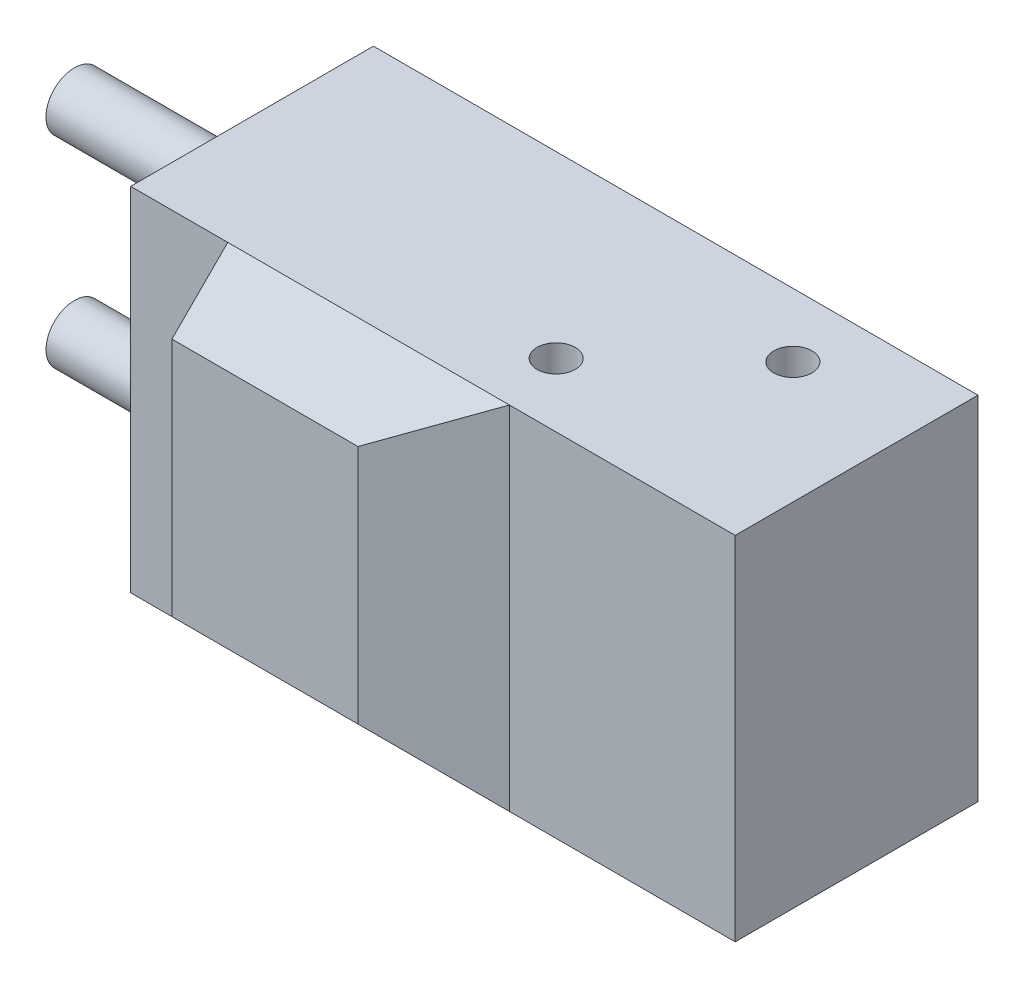
ISO-10303-21;
HEADER;
FILE_DESCRIPTION(('STEP AP214'),'2;1');
FILE_NAME('part.step','',(''),(''),'','','');
FILE_SCHEMA(('AUTOMOTIVE_DESIGN { 1 0 10303 214 1 1 1 1 }'));
ENDSEC;
DATA;
#1=APPLICATION_CONTEXT('core data for automotive mechanical design processes');
#2=APPLICATION_PROTOCOL_DEFINITION('international standard','automotive_design',2000,#1);
#3=PRODUCT_CONTEXT('',#1,'mechanical');
#4=PRODUCT('Part','Part','',(#3));
#5=PRODUCT_RELATED_PRODUCT_CATEGORY('part','',(#4));
#6=PRODUCT_DEFINITION_FORMATION('','',#4);
#7=PRODUCT_DEFINITION_CONTEXT('part definition',#1,'design');
#8=PRODUCT_DEFINITION('design','',#6,#7);
#9=PRODUCT_DEFINITION_SHAPE('','',#8);
#10=(LENGTH_UNIT() NAMED_UNIT(*) SI_UNIT(.MILLI.,.METRE.));
#11=(NAMED_UNIT(*) PLANE_ANGLE_UNIT() SI_UNIT($,.RADIAN.));
#12=(NAMED_UNIT(*) SI_UNIT($,.STERADIAN.) SOLID_ANGLE_UNIT());
#13=UNCERTAINTY_MEASURE_WITH_UNIT(LENGTH_MEASURE(1.E-05),#10,'distance_accuracy_value','');
#14=(GEOMETRIC_REPRESENTATION_CONTEXT(3) GLOBAL_UNCERTAINTY_ASSIGNED_CONTEXT((#13)) GLOBAL_UNIT_ASSIGNED_CONTEXT((#10,
#11,#12)) REPRESENTATION_CONTEXT('',''));
#15=CARTESIAN_POINT('',(0.,0.,0.));
#16=DIRECTION('',(0.,0.,1.));
#17=DIRECTION('',(1.,0.,0.));
#18=AXIS2_PLACEMENT_3D('',#15,#16,#17);
#19=CARTESIAN_POINT('',(0.,0.,25.4));
#20=DIRECTION('',(1.,0.,0.));
#21=DIRECTION('',(0.,0.,-1.));
#22=AXIS2_PLACEMENT_3D('',#19,#20,#21);
#23=PLANE('',#22);
#24=CARTESIAN_POINT('',(0.,28.956,12.7));
#25=DIRECTION('',(1.,0.,0.));
#26=DIRECTION('',(0.,0.,-1.));
#27=AXIS2_PLACEMENT_3D('',#24,#25,#26);
#28=CIRCLE('',#27,2.97815);
#29=CARTESIAN_POINT('',(0.,28.956,9.72185));
#30=VERTEX_POINT('',#29);
#31=EDGE_CURVE('E42',#30,#30,#28,.F.);
#32=ORIENTED_EDGE('',*,*,#31,.F.);
#33=EDGE_LOOP('',(#32));
#34=FACE_BOUND('',#33,.T.);
#35=DIRECTION('',(0.,-1.,0.));
#36=VECTOR('',#35,1.);
#37=CARTESIAN_POINT('',(0.,0.,0.));
#38=LINE('',#37,#36);
#39=CARTESIAN_POINT('',(0.,36.83,0.));
#40=VERTEX_POINT('',#39);
#41=CARTESIAN_POINT('',(0.,0.,0.));
#42=VERTEX_POINT('',#41);
#43=EDGE_CURVE('E206',#40,#42,#38,.T.);
#44=ORIENTED_EDGE('',*,*,#43,.T.);
#45=DIRECTION('',(0.,0.,-1.));
#46=VECTOR('',#45,1.);
#47=CARTESIAN_POINT('',(0.,0.,25.4));
#48=LINE('',#47,#46);
#49=CARTESIAN_POINT('',(0.,0.,25.4));
#50=VERTEX_POINT('',#49);
#51=EDGE_CURVE('E227',#50,#42,#48,.T.);
#52=ORIENTED_EDGE('',*,*,#51,.F.);
#53=DIRECTION('',(0.,-1.,0.));
#54=VECTOR('',#53,1.);
#55=CARTESIAN_POINT('',(0.,0.,25.4));
#56=LINE('',#55,#54);
#57=CARTESIAN_POINT('',(0.,36.83,25.4));
#58=VERTEX_POINT('',#57);
#59=EDGE_CURVE('E215',#58,#50,#56,.T.);
#60=ORIENTED_EDGE('',*,*,#59,.F.);
#61=DIRECTION('',(0.,0.,-1.));
#62=VECTOR('',#61,1.);
#63=CARTESIAN_POINT('',(0.,36.83,25.4));
#64=LINE('',#63,#62);
#65=EDGE_CURVE('E139',#58,#40,#64,.T.);
#66=ORIENTED_EDGE('',*,*,#65,.T.);
#67=EDGE_LOOP('',(#44,#52,#60,#66));
#68=FACE_BOUND('',#67,.T.);
#69=CARTESIAN_POINT('',(0.,7.87399999999999,12.7));
#70=DIRECTION('',(1.,0.,0.));
#71=DIRECTION('',(0.,0.,-1.));
#72=AXIS2_PLACEMENT_3D('',#69,#70,#71);
#73=CIRCLE('',#72,2.97815);
#74=CARTESIAN_POINT('',(0.,7.87399999999999,9.72185));
#75=VERTEX_POINT('',#74);
#76=EDGE_CURVE('E11',#75,#75,#73,.F.);
#77=ORIENTED_EDGE('',*,*,#76,.F.);
#78=EDGE_LOOP('',(#77));
#79=FACE_BOUND('',#78,.T.);
#80=ADVANCED_FACE('F35',(#34,#68,#79),#23,.F.);
#81=CARTESIAN_POINT('',(0.,36.83,25.4));
#82=DIRECTION('',(0.,0.,-1.));
#83=DIRECTION('',(-1.,0.,0.));
#84=AXIS2_PLACEMENT_3D('',#81,#82,#83);
#85=PLANE('',#84);
#86=DIRECTION('',(0.,-1.,0.));
#87=VECTOR('',#86,1.);
#88=CARTESIAN_POINT('',(10.16,0.,25.4));
#89=LINE('',#88,#87);
#90=CARTESIAN_POINT('',(10.16,36.83,25.4));
#91=VERTEX_POINT('',#90);
#92=CARTESIAN_POINT('',(10.16,0.,25.4));
#93=VERTEX_POINT('',#92);
#94=EDGE_CURVE('E143',#91,#93,#89,.T.);
#95=ORIENTED_EDGE('',*,*,#94,.F.);
#96=DIRECTION('',(-1.,0.,0.));
#97=VECTOR('',#96,1.);
#98=CARTESIAN_POINT('',(0.,36.83,25.4));
#99=LINE('',#98,#97);
#100=EDGE_CURVE('E129',#91,#58,#99,.T.);
#101=ORIENTED_EDGE('',*,*,#100,.T.);
#102=ORIENTED_EDGE('',*,*,#59,.T.);
#103=DIRECTION('',(1.,0.,0.));
#104=VECTOR('',#103,1.);
#105=CARTESIAN_POINT('',(0.,0.,25.4));
#106=LINE('',#105,#104);
#107=EDGE_CURVE('E224',#50,#93,#106,.T.);
#108=ORIENTED_EDGE('',*,*,#107,.T.);
#109=EDGE_LOOP('',(#95,#101,#102,#108));
#110=FACE_BOUND('',#109,.T.);
#111=ADVANCED_FACE('F254',(#110),#85,.F.);
#112=DIRECTION('',(0.,1.,0.));
#113=VECTOR('',#112,1.);
#114=CARTESIAN_POINT('',(39.624,0.,25.4));
#115=LINE('',#114,#113);
#116=CARTESIAN_POINT('',(39.624,0.,25.4));
#117=VERTEX_POINT('',#116);
#118=CARTESIAN_POINT('',(39.624,36.83,25.4));
#119=VERTEX_POINT('',#118);
#120=EDGE_CURVE('E134',#117,#119,#115,.T.);
#121=ORIENTED_EDGE('',*,*,#120,.F.);
#122=CARTESIAN_POINT('',(63.246,0.,25.4));
#123=VERTEX_POINT('',#122);
#124=EDGE_CURVE('E218',#117,#123,#106,.T.);
#125=ORIENTED_EDGE('',*,*,#124,.T.);
#126=DIRECTION('',(0.,1.,0.));
#127=VECTOR('',#126,1.);
#128=CARTESIAN_POINT('',(63.246,0.,25.4));
#129=LINE('',#128,#127);
#130=CARTESIAN_POINT('',(63.246,36.83,25.4));
#131=VERTEX_POINT('',#130);
#132=EDGE_CURVE('E137',#123,#131,#129,.T.);
#133=ORIENTED_EDGE('',*,*,#132,.T.);
#134=EDGE_CURVE('E127',#131,#119,#99,.T.);
#135=ORIENTED_EDGE('',*,*,#134,.T.);
#136=EDGE_LOOP('',(#121,#125,#133,#135));
#137=FACE_BOUND('',#136,.T.);
#138=ADVANCED_FACE('F133',(#137),#85,.F.);
#139=CARTESIAN_POINT('',(0.,0.,25.4));
#140=DIRECTION('',(0.,1.,0.));
#141=DIRECTION('',(0.,0.,1.));
#142=AXIS2_PLACEMENT_3D('',#139,#140,#141);
#143=PLANE('',#142);
#144=CARTESIAN_POINT('',(37.846,-2.22044604925031E-13,6.6675));
#145=DIRECTION('',(0.,-1.,0.));
#146=DIRECTION('',(0.,0.,-1.));
#147=AXIS2_PLACEMENT_3D('',#144,#145,#146);
#148=CIRCLE('',#147,1.99999999999978);
#149=CARTESIAN_POINT('',(37.846,-2.22044604925031E-13,4.66750000000022));
#150=VERTEX_POINT('',#149);
#151=EDGE_CURVE('E191',#150,#150,#148,.T.);
#152=ORIENTED_EDGE('',*,*,#151,.F.);
#153=EDGE_LOOP('',(#152));
#154=FACE_BOUND('',#153,.T.);
#155=CARTESIAN_POINT('',(50.546,-2.22044604925031E-13,18.7325));
#156=DIRECTION('',(0.,-1.,0.));
#157=DIRECTION('',(0.,0.,-1.));
#158=AXIS2_PLACEMENT_3D('',#155,#156,#157);
#159=CIRCLE('',#158,1.99999999999978);
#160=CARTESIAN_POINT('',(50.546,-2.22044604925031E-13,16.7325000000002));
#161=VERTEX_POINT('',#160);
#162=EDGE_CURVE('E203',#161,#161,#159,.T.);
#163=ORIENTED_EDGE('',*,*,#162,.F.);
#164=EDGE_LOOP('',(#163));
#165=FACE_BOUND('',#164,.T.);
#166=ORIENTED_EDGE('',*,*,#124,.F.);
#167=DIRECTION('',(-1.,0.,0.));
#168=VECTOR('',#167,1.);
#169=CARTESIAN_POINT('',(0.,0.,25.4));
#170=LINE('',#169,#168);
#171=EDGE_CURVE('E251',#117,#93,#170,.T.);
#172=ORIENTED_EDGE('',*,*,#171,.T.);
#173=ORIENTED_EDGE('',*,*,#107,.F.);
#174=ORIENTED_EDGE('',*,*,#51,.T.);
#175=DIRECTION('',(1.,0.,0.));
#176=VECTOR('',#175,1.);
#177=CARTESIAN_POINT('',(0.,0.,0.));
#178=LINE('',#177,#176);
#179=CARTESIAN_POINT('',(63.246,0.,0.));
#180=VERTEX_POINT('',#179);
#181=EDGE_CURVE('E209',#42,#180,#178,.T.);
#182=ORIENTED_EDGE('',*,*,#181,.T.);
#183=DIRECTION('',(0.,0.,-1.));
#184=VECTOR('',#183,1.);
#185=CARTESIAN_POINT('',(63.246,0.,25.4));
#186=LINE('',#185,#184);
#187=EDGE_CURVE('E231',#123,#180,#186,.T.);
#188=ORIENTED_EDGE('',*,*,#187,.F.);
#189=EDGE_LOOP('',(#166,#172,#173,#174,#182,#188));
#190=FACE_BOUND('',#189,.T.);
#191=ADVANCED_FACE('F250',(#154,#165,#190),#143,.F.);
#192=CARTESIAN_POINT('',(63.246,0.,25.4));
#193=DIRECTION('',(-1.,0.,0.));
#194=DIRECTION('',(0.,0.,1.));
#195=AXIS2_PLACEMENT_3D('',#192,#193,#194);
#196=PLANE('',#195);
#197=DIRECTION('',(0.,1.,0.));
#198=VECTOR('',#197,1.);
#199=CARTESIAN_POINT('',(63.246,0.,0.));
#200=LINE('',#199,#198);
#201=CARTESIAN_POINT('',(63.246,36.83,0.));
#202=VERTEX_POINT('',#201);
#203=EDGE_CURVE('E211',#180,#202,#200,.T.);
#204=ORIENTED_EDGE('',*,*,#203,.T.);
#205=DIRECTION('',(0.,0.,-1.));
#206=VECTOR('',#205,1.);
#207=CARTESIAN_POINT('',(63.246,36.83,25.4));
#208=LINE('',#207,#206);
#209=EDGE_CURVE('E234',#131,#202,#208,.T.);
#210=ORIENTED_EDGE('',*,*,#209,.F.);
#211=ORIENTED_EDGE('',*,*,#132,.F.);
#212=ORIENTED_EDGE('',*,*,#187,.T.);
#213=EDGE_LOOP('',(#204,#210,#211,#212));
#214=FACE_BOUND('',#213,.T.);
#215=ADVANCED_FACE('F298',(#214),#196,.F.);
#216=CARTESIAN_POINT('',(0.,36.83,25.4));
#217=DIRECTION('',(0.,-1.,0.));
#218=DIRECTION('',(0.,0.,-1.));
#219=AXIS2_PLACEMENT_3D('',#216,#217,#218);
#220=PLANE('',#219);
#221=CARTESIAN_POINT('',(50.546,36.8300000000002,6.6675));
#222=DIRECTION('',(0.,1.,0.));
#223=DIRECTION('',(0.,0.,1.));
#224=AXIS2_PLACEMENT_3D('',#221,#222,#223);
#225=CIRCLE('',#224,1.99999999999978);
#226=CARTESIAN_POINT('',(50.546,36.8300000000002,8.66749999999978));
#227=VERTEX_POINT('',#226);
#228=EDGE_CURVE('E167',#227,#227,#225,.T.);
#229=ORIENTED_EDGE('',*,*,#228,.F.);
#230=EDGE_LOOP('',(#229));
#231=FACE_BOUND('',#230,.T.);
#232=CARTESIAN_POINT('',(37.846,36.8300000000002,18.7325));
#233=DIRECTION('',(0.,1.,0.));
#234=DIRECTION('',(0.,0.,1.));
#235=AXIS2_PLACEMENT_3D('',#232,#233,#234);
#236=CIRCLE('',#235,1.99999999999978);
#237=CARTESIAN_POINT('',(37.846,36.8300000000002,20.7324999999998));
#238=VERTEX_POINT('',#237);
#239=EDGE_CURVE('E179',#238,#238,#236,.T.);
#240=ORIENTED_EDGE('',*,*,#239,.F.);
#241=EDGE_LOOP('',(#240));
#242=FACE_BOUND('',#241,.T.);
#243=ORIENTED_EDGE('',*,*,#100,.F.);
#244=DIRECTION('',(1.,0.,0.));
#245=VECTOR('',#244,1.);
#246=CARTESIAN_POINT('',(0.,36.83,25.4));
#247=LINE('',#246,#245);
#248=EDGE_CURVE('E117',#91,#119,#247,.T.);
#249=ORIENTED_EDGE('',*,*,#248,.T.);
#250=ORIENTED_EDGE('',*,*,#134,.F.);
#251=ORIENTED_EDGE('',*,*,#209,.T.);
#252=DIRECTION('',(-1.,0.,0.));
#253=VECTOR('',#252,1.);
#254=CARTESIAN_POINT('',(0.,36.83,0.));
#255=LINE('',#254,#253);
#256=EDGE_CURVE('E213',#202,#40,#255,.T.);
#257=ORIENTED_EDGE('',*,*,#256,.T.);
#258=ORIENTED_EDGE('',*,*,#65,.F.);
#259=EDGE_LOOP('',(#243,#249,#250,#251,#257,#258));
#260=FACE_BOUND('',#259,.T.);
#261=ADVANCED_FACE('F125',(#231,#242,#260),#220,.F.);
#262=CARTESIAN_POINT('',(0.,36.83,0.));
#263=DIRECTION('',(0.,0.,-1.));
#264=DIRECTION('',(-1.,0.,0.));
#265=AXIS2_PLACEMENT_3D('',#262,#263,#264);
#266=PLANE('',#265);
#267=ORIENTED_EDGE('',*,*,#43,.F.);
#268=ORIENTED_EDGE('',*,*,#256,.F.);
#269=ORIENTED_EDGE('',*,*,#203,.F.);
#270=ORIENTED_EDGE('',*,*,#181,.F.);
#271=EDGE_LOOP('',(#267,#268,#269,#270));
#272=FACE_BOUND('',#271,.T.);
#273=ADVANCED_FACE('F246',(#272),#266,.T.);
#274=CARTESIAN_POINT('',(50.546,0.,18.7325));
#275=DIRECTION('',(0.,-1.,0.));
#276=DIRECTION('',(0.,0.,-1.));
#277=AXIS2_PLACEMENT_3D('',#274,#275,#276);
#278=CYLINDRICAL_SURFACE('',#277,1.99999999999979);
#279=CARTESIAN_POINT('',(50.546,8.0000093999999,18.7325));
#280=DIRECTION('',(0.,-1.,0.));
#281=DIRECTION('',(0.,0.,-1.));
#282=AXIS2_PLACEMENT_3D('',#279,#280,#281);
#283=CIRCLE('',#282,1.99999999999981);
#284=CARTESIAN_POINT('',(50.546,8.0000093999999,16.7325000000002));
#285=VERTEX_POINT('',#284);
#286=EDGE_CURVE('E200',#285,#285,#283,.T.);
#287=ORIENTED_EDGE('',*,*,#286,.F.);
#288=EDGE_LOOP('',(#287));
#289=FACE_BOUND('',#288,.T.);
#290=ORIENTED_EDGE('',*,*,#162,.T.);
#291=EDGE_LOOP('',(#290));
#292=FACE_BOUND('',#291,.T.);
#293=ADVANCED_FACE('F310',(#289,#292),#278,.F.);
#294=CARTESIAN_POINT('',(52.196,8.0000093999999,18.7325));
#295=DIRECTION('',(0.,1.,0.));
#296=DIRECTION('',(0.,0.,1.));
#297=AXIS2_PLACEMENT_3D('',#294,#295,#296);
#298=PLANE('',#297);
#299=CARTESIAN_POINT('',(50.546,8.0000093999999,18.7325));
#300=DIRECTION('',(0.,-1.,0.));
#301=DIRECTION('',(0.,0.,-1.));
#302=AXIS2_PLACEMENT_3D('',#299,#300,#301);
#303=CIRCLE('',#302,1.65);
#304=CARTESIAN_POINT('',(50.546,8.0000093999999,17.0825));
#305=VERTEX_POINT('',#304);
#306=EDGE_CURVE('E197',#305,#305,#303,.T.);
#307=ORIENTED_EDGE('',*,*,#306,.F.);
#308=EDGE_LOOP('',(#307));
#309=FACE_BOUND('',#308,.T.);
#310=ORIENTED_EDGE('',*,*,#286,.T.);
#311=EDGE_LOOP('',(#310));
#312=FACE_BOUND('',#311,.T.);
#313=ADVANCED_FACE('F312',(#309,#312),#298,.F.);
#314=CARTESIAN_POINT('',(50.546,0.,18.7325));
#315=DIRECTION('',(0.,-1.,0.));
#316=DIRECTION('',(0.,0.,-1.));
#317=AXIS2_PLACEMENT_3D('',#314,#315,#316);
#318=CYLINDRICAL_SURFACE('',#317,1.65);
#319=CARTESIAN_POINT('',(50.546,5.08,18.7325));
#320=DIRECTION('',(0.,-1.,0.));
#321=DIRECTION('',(0.,0.,-1.));
#322=AXIS2_PLACEMENT_3D('',#319,#320,#321);
#323=CIRCLE('',#322,1.65);
#324=CARTESIAN_POINT('',(50.546,5.08,17.0825));
#325=VERTEX_POINT('',#324);
#326=EDGE_CURVE('E194',#325,#325,#323,.T.);
#327=ORIENTED_EDGE('',*,*,#326,.F.);
#328=EDGE_LOOP('',(#327));
#329=FACE_BOUND('',#328,.T.);
#330=ORIENTED_EDGE('',*,*,#306,.T.);
#331=EDGE_LOOP('',(#330));
#332=FACE_BOUND('',#331,.T.);
#333=ADVANCED_FACE('F318',(#329,#332),#318,.T.);
#334=CARTESIAN_POINT('',(50.546,5.08,18.7325));
#335=DIRECTION('',(0.,-1.,0.));
#336=DIRECTION('',(0.,0.,-1.));
#337=AXIS2_PLACEMENT_3D('',#334,#335,#336);
#338=CONICAL_SURFACE('',#337,1.65,1.02974425867665);
#339=CARTESIAN_POINT('',(50.546,6.07142002139547,18.7325));
#340=VERTEX_POINT('',#339);
#341=VERTEX_LOOP('',#340);
#342=FACE_BOUND('',#341,.T.);
#343=ORIENTED_EDGE('',*,*,#326,.T.);
#344=EDGE_LOOP('',(#343));
#345=FACE_BOUND('',#344,.T.);
#346=ADVANCED_FACE('F325',(#342,#345),#338,.F.);
#347=CARTESIAN_POINT('',(37.846,0.,6.6675));
#348=DIRECTION('',(0.,-1.,0.));
#349=DIRECTION('',(0.,0.,-1.));
#350=AXIS2_PLACEMENT_3D('',#347,#348,#349);
#351=CYLINDRICAL_SURFACE('',#350,1.99999999999979);
#352=CARTESIAN_POINT('',(37.846,8.0000093999999,6.6675));
#353=DIRECTION('',(0.,-1.,0.));
#354=DIRECTION('',(0.,0.,-1.));
#355=AXIS2_PLACEMENT_3D('',#352,#353,#354);
#356=CIRCLE('',#355,1.99999999999981);
#357=CARTESIAN_POINT('',(37.846,8.0000093999999,4.66750000000019));
#358=VERTEX_POINT('',#357);
#359=EDGE_CURVE('E188',#358,#358,#356,.T.);
#360=ORIENTED_EDGE('',*,*,#359,.F.);
#361=EDGE_LOOP('',(#360));
#362=FACE_BOUND('',#361,.T.);
#363=ORIENTED_EDGE('',*,*,#151,.T.);
#364=EDGE_LOOP('',(#363));
#365=FACE_BOUND('',#364,.T.);
#366=ADVANCED_FACE('F329',(#362,#365),#351,.F.);
#367=CARTESIAN_POINT('',(39.496,8.0000093999999,6.6675));
#368=DIRECTION('',(0.,1.,0.));
#369=DIRECTION('',(0.,0.,1.));
#370=AXIS2_PLACEMENT_3D('',#367,#368,#369);
#371=PLANE('',#370);
#372=CARTESIAN_POINT('',(37.846,8.0000093999999,6.6675));
#373=DIRECTION('',(0.,-1.,0.));
#374=DIRECTION('',(0.,0.,-1.));
#375=AXIS2_PLACEMENT_3D('',#372,#373,#374);
#376=CIRCLE('',#375,1.65);
#377=CARTESIAN_POINT('',(37.846,8.0000093999999,5.0175));
#378=VERTEX_POINT('',#377);
#379=EDGE_CURVE('E185',#378,#378,#376,.T.);
#380=ORIENTED_EDGE('',*,*,#379,.F.);
#381=EDGE_LOOP('',(#380));
#382=FACE_BOUND('',#381,.T.);
#383=ORIENTED_EDGE('',*,*,#359,.T.);
#384=EDGE_LOOP('',(#383));
#385=FACE_BOUND('',#384,.T.);
#386=ADVANCED_FACE('F333',(#382,#385),#371,.F.);
#387=CARTESIAN_POINT('',(37.846,0.,6.6675));
#388=DIRECTION('',(0.,-1.,0.));
#389=DIRECTION('',(0.,0.,-1.));
#390=AXIS2_PLACEMENT_3D('',#387,#388,#389);
#391=CYLINDRICAL_SURFACE('',#390,1.65);
#392=CARTESIAN_POINT('',(37.846,5.08,6.6675));
#393=DIRECTION('',(0.,-1.,0.));
#394=DIRECTION('',(0.,0.,-1.));
#395=AXIS2_PLACEMENT_3D('',#392,#393,#394);
#396=CIRCLE('',#395,1.65);
#397=CARTESIAN_POINT('',(37.846,5.08,5.0175));
#398=VERTEX_POINT('',#397);
#399=EDGE_CURVE('E182',#398,#398,#396,.T.);
#400=ORIENTED_EDGE('',*,*,#399,.F.);
#401=EDGE_LOOP('',(#400));
#402=FACE_BOUND('',#401,.T.);
#403=ORIENTED_EDGE('',*,*,#379,.T.);
#404=EDGE_LOOP('',(#403));
#405=FACE_BOUND('',#404,.T.);
#406=ADVANCED_FACE('F337',(#402,#405),#391,.T.);
#407=CARTESIAN_POINT('',(37.846,5.08,6.6675));
#408=DIRECTION('',(0.,-1.,0.));
#409=DIRECTION('',(0.,0.,-1.));
#410=AXIS2_PLACEMENT_3D('',#407,#408,#409);
#411=CONICAL_SURFACE('',#410,1.65,1.02974425867665);
#412=CARTESIAN_POINT('',(37.846,6.07142002139547,6.6675));
#413=VERTEX_POINT('',#412);
#414=VERTEX_LOOP('',#413);
#415=FACE_BOUND('',#414,.T.);
#416=ORIENTED_EDGE('',*,*,#399,.T.);
#417=EDGE_LOOP('',(#416));
#418=FACE_BOUND('',#417,.T.);
#419=ADVANCED_FACE('F341',(#415,#418),#411,.F.);
#420=CARTESIAN_POINT('',(37.846,36.83,18.7325));
#421=DIRECTION('',(0.,1.,0.));
#422=DIRECTION('',(0.,0.,1.));
#423=AXIS2_PLACEMENT_3D('',#420,#421,#422);
#424=CYLINDRICAL_SURFACE('',#423,1.99999999999979);
#425=CARTESIAN_POINT('',(37.846,28.8299906000001,18.7325));
#426=DIRECTION('',(0.,1.,0.));
#427=DIRECTION('',(0.,0.,1.));
#428=AXIS2_PLACEMENT_3D('',#425,#426,#427);
#429=CIRCLE('',#428,1.99999999999981);
#430=CARTESIAN_POINT('',(37.846,28.8299906000001,20.7324999999998));
#431=VERTEX_POINT('',#430);
#432=EDGE_CURVE('E176',#431,#431,#429,.T.);
#433=ORIENTED_EDGE('',*,*,#432,.F.);
#434=EDGE_LOOP('',(#433));
#435=FACE_BOUND('',#434,.T.);
#436=ORIENTED_EDGE('',*,*,#239,.T.);
#437=EDGE_LOOP('',(#436));
#438=FACE_BOUND('',#437,.T.);
#439=ADVANCED_FACE('F345',(#435,#438),#424,.F.);
#440=CARTESIAN_POINT('',(39.496,28.8299906000001,18.7325));
#441=DIRECTION('',(0.,-1.,0.));
#442=DIRECTION('',(0.,0.,-1.));
#443=AXIS2_PLACEMENT_3D('',#440,#441,#442);
#444=PLANE('',#443);
#445=CARTESIAN_POINT('',(37.846,28.8299906000001,18.7325));
#446=DIRECTION('',(0.,1.,0.));
#447=DIRECTION('',(0.,0.,1.));
#448=AXIS2_PLACEMENT_3D('',#445,#446,#447);
#449=CIRCLE('',#448,1.65);
#450=CARTESIAN_POINT('',(37.846,28.8299906000001,20.3825));
#451=VERTEX_POINT('',#450);
#452=EDGE_CURVE('E173',#451,#451,#449,.T.);
#453=ORIENTED_EDGE('',*,*,#452,.F.);
#454=EDGE_LOOP('',(#453));
#455=FACE_BOUND('',#454,.T.);
#456=ORIENTED_EDGE('',*,*,#432,.T.);
#457=EDGE_LOOP('',(#456));
#458=FACE_BOUND('',#457,.T.);
#459=ADVANCED_FACE('F349',(#455,#458),#444,.F.);
#460=CARTESIAN_POINT('',(37.846,36.83,18.7325));
#461=DIRECTION('',(0.,1.,0.));
#462=DIRECTION('',(0.,0.,1.));
#463=AXIS2_PLACEMENT_3D('',#460,#461,#462);
#464=CYLINDRICAL_SURFACE('',#463,1.65);
#465=CARTESIAN_POINT('',(37.846,31.75,18.7325));
#466=DIRECTION('',(0.,1.,0.));
#467=DIRECTION('',(0.,0.,1.));
#468=AXIS2_PLACEMENT_3D('',#465,#466,#467);
#469=CIRCLE('',#468,1.65);
#470=CARTESIAN_POINT('',(37.846,31.75,20.3825));
#471=VERTEX_POINT('',#470);
#472=EDGE_CURVE('E170',#471,#471,#469,.T.);
#473=ORIENTED_EDGE('',*,*,#472,.F.);
#474=EDGE_LOOP('',(#473));
#475=FACE_BOUND('',#474,.T.);
#476=ORIENTED_EDGE('',*,*,#452,.T.);
#477=EDGE_LOOP('',(#476));
#478=FACE_BOUND('',#477,.T.);
#479=ADVANCED_FACE('F353',(#475,#478),#464,.T.);
#480=CARTESIAN_POINT('',(37.846,31.75,18.7325));
#481=DIRECTION('',(0.,1.,0.));
#482=DIRECTION('',(0.,0.,1.));
#483=AXIS2_PLACEMENT_3D('',#480,#481,#482);
#484=CONICAL_SURFACE('',#483,1.65,1.02974425867665);
#485=CARTESIAN_POINT('',(37.846,30.7585799786045,18.7325));
#486=VERTEX_POINT('',#485);
#487=VERTEX_LOOP('',#486);
#488=FACE_BOUND('',#487,.T.);
#489=ORIENTED_EDGE('',*,*,#472,.T.);
#490=EDGE_LOOP('',(#489));
#491=FACE_BOUND('',#490,.T.);
#492=ADVANCED_FACE('F357',(#488,#491),#484,.F.);
#493=CARTESIAN_POINT('',(50.546,36.83,6.6675));
#494=DIRECTION('',(0.,1.,0.));
#495=DIRECTION('',(0.,0.,1.));
#496=AXIS2_PLACEMENT_3D('',#493,#494,#495);
#497=CYLINDRICAL_SURFACE('',#496,1.99999999999979);
#498=CARTESIAN_POINT('',(50.546,28.8299906000001,6.6675));
#499=DIRECTION('',(0.,1.,0.));
#500=DIRECTION('',(0.,0.,1.));
#501=AXIS2_PLACEMENT_3D('',#498,#499,#500);
#502=CIRCLE('',#501,1.99999999999981);
#503=CARTESIAN_POINT('',(50.546,28.8299906000001,8.66749999999981));
#504=VERTEX_POINT('',#503);
#505=EDGE_CURVE('E164',#504,#504,#502,.T.);
#506=ORIENTED_EDGE('',*,*,#505,.F.);
#507=EDGE_LOOP('',(#506));
#508=FACE_BOUND('',#507,.T.);
#509=ORIENTED_EDGE('',*,*,#228,.T.);
#510=EDGE_LOOP('',(#509));
#511=FACE_BOUND('',#510,.T.);
#512=ADVANCED_FACE('F361',(#508,#511),#497,.F.);
#513=CARTESIAN_POINT('',(52.196,28.8299906000001,6.6675));
#514=DIRECTION('',(0.,-1.,0.));
#515=DIRECTION('',(0.,0.,-1.));
#516=AXIS2_PLACEMENT_3D('',#513,#514,#515);
#517=PLANE('',#516);
#518=CARTESIAN_POINT('',(50.546,28.8299906000001,6.6675));
#519=DIRECTION('',(0.,1.,0.));
#520=DIRECTION('',(0.,0.,1.));
#521=AXIS2_PLACEMENT_3D('',#518,#519,#520);
#522=CIRCLE('',#521,1.65);
#523=CARTESIAN_POINT('',(50.546,28.8299906000001,8.3175));
#524=VERTEX_POINT('',#523);
#525=EDGE_CURVE('E161',#524,#524,#522,.T.);
#526=ORIENTED_EDGE('',*,*,#525,.F.);
#527=EDGE_LOOP('',(#526));
#528=FACE_BOUND('',#527,.T.);
#529=ORIENTED_EDGE('',*,*,#505,.T.);
#530=EDGE_LOOP('',(#529));
#531=FACE_BOUND('',#530,.T.);
#532=ADVANCED_FACE('F365',(#528,#531),#517,.F.);
#533=CARTESIAN_POINT('',(50.546,36.83,6.6675));
#534=DIRECTION('',(0.,1.,0.));
#535=DIRECTION('',(0.,0.,1.));
#536=AXIS2_PLACEMENT_3D('',#533,#534,#535);
#537=CYLINDRICAL_SURFACE('',#536,1.65);
#538=CARTESIAN_POINT('',(50.546,31.75,6.6675));
#539=DIRECTION('',(0.,1.,0.));
#540=DIRECTION('',(0.,0.,1.));
#541=AXIS2_PLACEMENT_3D('',#538,#539,#540);
#542=CIRCLE('',#541,1.65);
#543=CARTESIAN_POINT('',(50.546,31.75,8.3175));
#544=VERTEX_POINT('',#543);
#545=EDGE_CURVE('E145',#544,#544,#542,.T.);
#546=ORIENTED_EDGE('',*,*,#545,.F.);
#547=EDGE_LOOP('',(#546));
#548=FACE_BOUND('',#547,.T.);
#549=ORIENTED_EDGE('',*,*,#525,.T.);
#550=EDGE_LOOP('',(#549));
#551=FACE_BOUND('',#550,.T.);
#552=ADVANCED_FACE('F369',(#548,#551),#537,.T.);
#553=CARTESIAN_POINT('',(50.546,31.75,6.6675));
#554=DIRECTION('',(0.,1.,0.));
#555=DIRECTION('',(0.,0.,1.));
#556=AXIS2_PLACEMENT_3D('',#553,#554,#555);
#557=CONICAL_SURFACE('',#556,1.65,1.02974425867665);
#558=CARTESIAN_POINT('',(50.546,30.7585799786045,6.6675));
#559=VERTEX_POINT('',#558);
#560=VERTEX_LOOP('',#559);
#561=FACE_BOUND('',#560,.T.);
#562=ORIENTED_EDGE('',*,*,#545,.T.);
#563=EDGE_LOOP('',(#562));
#564=FACE_BOUND('',#563,.T.);
#565=ADVANCED_FACE('F373',(#561,#564),#557,.F.);
#566=CARTESIAN_POINT('',(10.16,0.,31.242));
#567=DIRECTION('',(1.,0.,0.));
#568=DIRECTION('',(0.,0.,-1.));
#569=AXIS2_PLACEMENT_3D('',#566,#567,#568);
#570=PLANE('',#569);
#571=DIRECTION('',(0.,-1.,0.));
#572=VECTOR('',#571,1.);
#573=CARTESIAN_POINT('',(10.16,0.,31.242));
#574=LINE('',#573,#572);
#575=CARTESIAN_POINT('',(10.16,30.988,31.242));
#576=VERTEX_POINT('',#575);
#577=CARTESIAN_POINT('',(10.16,5.842,31.242));
#578=VERTEX_POINT('',#577);
#579=EDGE_CURVE('E142',#576,#578,#574,.T.);
#580=ORIENTED_EDGE('',*,*,#579,.F.);
#581=DIRECTION('',(0.,-0.707106781186546,0.707106781186549));
#582=VECTOR('',#581,1.);
#583=CARTESIAN_POINT('',(10.16,30.988,31.242));
#584=LINE('',#583,#582);
#585=EDGE_CURVE('E130',#576,#91,#584,.F.);
#586=ORIENTED_EDGE('',*,*,#585,.T.);
#587=ORIENTED_EDGE('',*,*,#94,.T.);
#588=DIRECTION('',(0.,-0.707106781186546,-0.707106781186549));
#589=VECTOR('',#588,1.);
#590=CARTESIAN_POINT('',(10.16,5.842,31.242));
#591=LINE('',#590,#589);
#592=EDGE_CURVE('E260',#93,#578,#591,.F.);
#593=ORIENTED_EDGE('',*,*,#592,.T.);
#594=EDGE_LOOP('',(#580,#586,#587,#593));
#595=FACE_BOUND('',#594,.T.);
#596=ADVANCED_FACE('F259',(#595),#570,.F.);
#597=CARTESIAN_POINT('',(10.16,36.83,31.242));
#598=DIRECTION('',(0.,0.,-1.));
#599=DIRECTION('',(-1.,0.,0.));
#600=AXIS2_PLACEMENT_3D('',#597,#598,#599);
#601=PLANE('',#600);
#602=DIRECTION('',(1.,0.,0.));
#603=VECTOR('',#602,1.);
#604=CARTESIAN_POINT('',(10.16,5.842,31.242));
#605=LINE('',#604,#603);
#606=CARTESIAN_POINT('',(29.6239999999999,5.842,31.242));
#607=VERTEX_POINT('',#606);
#608=EDGE_CURVE('E230',#578,#607,#605,.T.);
#609=ORIENTED_EDGE('',*,*,#608,.T.);
#610=DIRECTION('',(0.,1.,0.));
#611=VECTOR('',#610,1.);
#612=CARTESIAN_POINT('',(29.6239999999999,36.83,31.242));
#613=LINE('',#612,#611);
#614=CARTESIAN_POINT('',(29.6239999999999,30.988,31.242));
#615=VERTEX_POINT('',#614);
#616=EDGE_CURVE('E119',#607,#615,#613,.T.);
#617=ORIENTED_EDGE('',*,*,#616,.T.);
#618=DIRECTION('',(-1.,0.,0.));
#619=VECTOR('',#618,1.);
#620=CARTESIAN_POINT('',(10.16,30.988,31.242));
#621=LINE('',#620,#619);
#622=EDGE_CURVE('E118',#615,#576,#621,.T.);
#623=ORIENTED_EDGE('',*,*,#622,.T.);
#624=ORIENTED_EDGE('',*,*,#579,.T.);
#625=EDGE_LOOP('',(#609,#617,#623,#624));
#626=FACE_BOUND('',#625,.T.);
#627=ADVANCED_FACE('F380',(#626),#601,.F.);
#628=CARTESIAN_POINT('',(10.16,5.842,31.242));
#629=DIRECTION('',(0.,0.707106781186549,-0.707106781186546));
#630=DIRECTION('',(0.,0.707106781186546,0.707106781186549));
#631=AXIS2_PLACEMENT_3D('',#628,#629,#630);
#632=PLANE('',#631);
#633=ORIENTED_EDGE('',*,*,#171,.F.);
#634=DIRECTION('',(-0.770925181570921,0.450374491073729,0.450374491073731));
#635=VECTOR('',#634,1.);
#636=CARTESIAN_POINT('',(18.0560458290678,12.5999988266585,37.9999988266585));
#637=LINE('',#636,#635);
#638=EDGE_CURVE('E49',#117,#607,#637,.T.);
#639=ORIENTED_EDGE('',*,*,#638,.T.);
#640=ORIENTED_EDGE('',*,*,#608,.F.);
#641=ORIENTED_EDGE('',*,*,#592,.F.);
#642=EDGE_LOOP('',(#633,#639,#640,#641));
#643=FACE_BOUND('',#642,.T.);
#644=ADVANCED_FACE('F261',(#643),#632,.F.);
#645=CARTESIAN_POINT('',(10.16,30.988,31.242));
#646=DIRECTION('',(0.,-0.707106781186549,-0.707106781186546));
#647=DIRECTION('',(0.,0.707106781186546,-0.707106781186549));
#648=AXIS2_PLACEMENT_3D('',#645,#646,#647);
#649=PLANE('',#648);
#650=ORIENTED_EDGE('',*,*,#622,.F.);
#651=DIRECTION('',(0.770925181570921,0.450374491073729,-0.450374491073731));
#652=VECTOR('',#651,1.);
#653=CARTESIAN_POINT('',(18.0560458290678,24.2300011733415,37.9999988266585));
#654=LINE('',#653,#652);
#655=EDGE_CURVE('E57',#615,#119,#654,.T.);
#656=ORIENTED_EDGE('',*,*,#655,.T.);
#657=ORIENTED_EDGE('',*,*,#248,.F.);
#658=ORIENTED_EDGE('',*,*,#585,.F.);
#659=EDGE_LOOP('',(#650,#656,#657,#658));
#660=FACE_BOUND('',#659,.T.);
#661=ADVANCED_FACE('F115',(#660),#649,.F.);
#662=CARTESIAN_POINT('',(29.6239999999999,36.83,31.242));
#663=DIRECTION('',(-0.504429256724268,0.,-0.863453024177113));
#664=DIRECTION('',(-0.863453024177113,0.,0.504429256724268));
#665=AXIS2_PLACEMENT_3D('',#662,#663,#664);
#666=PLANE('',#665);
#667=ORIENTED_EDGE('',*,*,#638,.F.);
#668=ORIENTED_EDGE('',*,*,#120,.T.);
#669=ORIENTED_EDGE('',*,*,#655,.F.);
#670=ORIENTED_EDGE('',*,*,#616,.F.);
#671=EDGE_LOOP('',(#667,#668,#669,#670));
#672=FACE_BOUND('',#671,.T.);
#673=ADVANCED_FACE('F141',(#672),#666,.F.);
#674=CARTESIAN_POINT('',(-18.5801,28.956,12.7));
#675=DIRECTION('',(1.,0.,0.));
#676=DIRECTION('',(0.,0.,-1.));
#677=AXIS2_PLACEMENT_3D('',#674,#675,#676);
#678=CYLINDRICAL_SURFACE('',#677,2.97815);
#679=CARTESIAN_POINT('',(-18.5801,28.956,12.7));
#680=DIRECTION('',(-1.,0.,0.));
#681=DIRECTION('',(0.,0.,1.));
#682=AXIS2_PLACEMENT_3D('',#679,#680,#681);
#683=CIRCLE('',#682,2.97815);
#684=CARTESIAN_POINT('',(-18.5801,28.956,15.67815));
#685=VERTEX_POINT('',#684);
#686=EDGE_CURVE('E148',#685,#685,#683,.T.);
#687=ORIENTED_EDGE('',*,*,#686,.F.);
#688=EDGE_LOOP('',(#687));
#689=FACE_BOUND('',#688,.T.);
#690=ORIENTED_EDGE('',*,*,#31,.T.);
#691=EDGE_LOOP('',(#690));
#692=FACE_BOUND('',#691,.T.);
#693=ADVANCED_FACE('F283',(#689,#692),#678,.T.);
#694=CARTESIAN_POINT('',(-18.5801,28.956,12.7));
#695=DIRECTION('',(-1.,0.,0.));
#696=DIRECTION('',(0.,0.,1.));
#697=AXIS2_PLACEMENT_3D('',#694,#695,#696);
#698=PLANE('',#697);
#699=ORIENTED_EDGE('',*,*,#686,.T.);
#700=EDGE_LOOP('',(#699));
#701=FACE_BOUND('',#700,.T.);
#702=ADVANCED_FACE('F392',(#701),#698,.T.);
#703=CARTESIAN_POINT('',(-18.5801,7.87399999999999,12.7));
#704=DIRECTION('',(1.,0.,0.));
#705=DIRECTION('',(0.,0.,-1.));
#706=AXIS2_PLACEMENT_3D('',#703,#704,#705);
#707=CYLINDRICAL_SURFACE('',#706,2.97815);
#708=CARTESIAN_POINT('',(-18.5801,7.87399999999999,12.7));
#709=DIRECTION('',(-1.,0.,0.));
#710=DIRECTION('',(0.,0.,1.));
#711=AXIS2_PLACEMENT_3D('',#708,#709,#710);
#712=CIRCLE('',#711,2.97815);
#713=CARTESIAN_POINT('',(-18.5801,7.87399999999999,15.67815));
#714=VERTEX_POINT('',#713);
#715=EDGE_CURVE('E408',#714,#714,#712,.T.);
#716=ORIENTED_EDGE('',*,*,#715,.F.);
#717=EDGE_LOOP('',(#716));
#718=FACE_BOUND('',#717,.T.);
#719=ORIENTED_EDGE('',*,*,#76,.T.);
#720=EDGE_LOOP('',(#719));
#721=FACE_BOUND('',#720,.T.);
#722=ADVANCED_FACE('F396',(#718,#721),#707,.T.);
#723=CARTESIAN_POINT('',(-18.5801,7.87399999999999,12.7));
#724=DIRECTION('',(-1.,0.,0.));
#725=DIRECTION('',(0.,0.,1.));
#726=AXIS2_PLACEMENT_3D('',#723,#724,#725);
#727=PLANE('',#726);
#728=ORIENTED_EDGE('',*,*,#715,.T.);
#729=EDGE_LOOP('',(#728));
#730=FACE_BOUND('',#729,.T.);
#731=ADVANCED_FACE('F400',(#730),#727,.T.);
#732=CLOSED_SHELL('',(#80,#111,#138,#191,#215,#261,#273,#293,#313,#333,#346,#366,#386,#406,#419,
#439,#459,#479,#492,#512,#532,#552,#565,#596,#627,#644,#661,#673,#693,#702,#722,#731));
#733=MANIFOLD_SOLID_BREP('B2',#732);
#734=ADVANCED_BREP_SHAPE_REPRESENTATION('',(#18,#733),#14);
#735=SHAPE_DEFINITION_REPRESENTATION(#9,#734);
ENDSEC;
END-ISO-10303-21;
